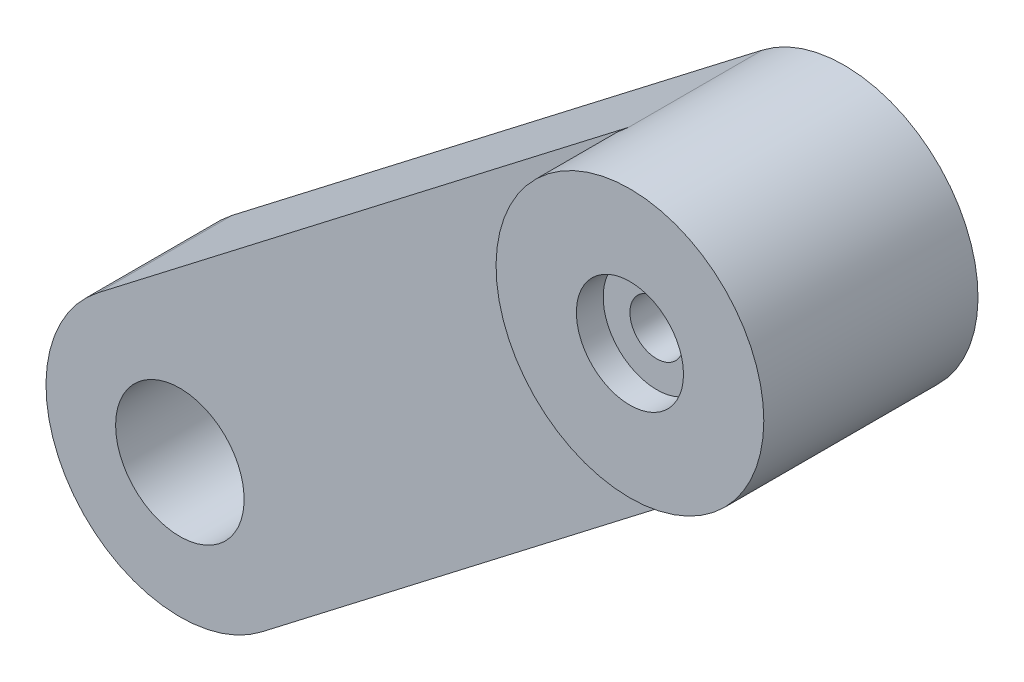
ISO-10303-21;
HEADER;
FILE_DESCRIPTION(('STEP AP214'),'2;1');
FILE_NAME('part.step','',(''),(''),'','','');
FILE_SCHEMA(('AUTOMOTIVE_DESIGN { 1 0 10303 214 1 1 1 1 }'));
ENDSEC;
DATA;
#1=APPLICATION_CONTEXT('core data for automotive mechanical design processes');
#2=APPLICATION_PROTOCOL_DEFINITION('international standard','automotive_design',2000,#1);
#3=PRODUCT_CONTEXT('',#1,'mechanical');
#4=PRODUCT('Part','Part','',(#3));
#5=PRODUCT_RELATED_PRODUCT_CATEGORY('part','',(#4));
#6=PRODUCT_DEFINITION_FORMATION('','',#4);
#7=PRODUCT_DEFINITION_CONTEXT('part definition',#1,'design');
#8=PRODUCT_DEFINITION('design','',#6,#7);
#9=PRODUCT_DEFINITION_SHAPE('','',#8);
#10=(LENGTH_UNIT() NAMED_UNIT(*) SI_UNIT(.MILLI.,.METRE.));
#11=(NAMED_UNIT(*) PLANE_ANGLE_UNIT() SI_UNIT($,.RADIAN.));
#12=(NAMED_UNIT(*) SI_UNIT($,.STERADIAN.) SOLID_ANGLE_UNIT());
#13=UNCERTAINTY_MEASURE_WITH_UNIT(LENGTH_MEASURE(1.E-05),#10,'distance_accuracy_value','');
#14=(GEOMETRIC_REPRESENTATION_CONTEXT(3) GLOBAL_UNCERTAINTY_ASSIGNED_CONTEXT((#13)) GLOBAL_UNIT_ASSIGNED_CONTEXT((#10,
#11,#12)) REPRESENTATION_CONTEXT('',''));
#15=CARTESIAN_POINT('',(0.,0.,0.));
#16=DIRECTION('',(0.,0.,1.));
#17=DIRECTION('',(1.,0.,0.));
#18=AXIS2_PLACEMENT_3D('',#15,#16,#17);
#19=CARTESIAN_POINT('',(-24.5716026079148,99.9472921619681,8.));
#20=DIRECTION('',(0.,0.,-1.));
#21=DIRECTION('',(-1.,0.,0.));
#22=AXIS2_PLACEMENT_3D('',#19,#20,#21);
#23=CYLINDRICAL_SURFACE('',#22,1.00000000000002);
#24=CARTESIAN_POINT('',(-24.5716026079148,99.9472921619681,5.));
#25=DIRECTION('',(0.,0.,1.));
#26=DIRECTION('',(1.,0.,0.));
#27=AXIS2_PLACEMENT_3D('',#24,#25,#26);
#28=CIRCLE('',#27,1.00000000000002);
#29=CARTESIAN_POINT('',(-23.5716026079148,99.9472921619681,5.));
#30=VERTEX_POINT('',#29);
#31=EDGE_CURVE('E123',#30,#30,#28,.T.);
#32=ORIENTED_EDGE('',*,*,#31,.F.);
#33=EDGE_LOOP('',(#32));
#34=FACE_BOUND('',#33,.T.);
#35=CARTESIAN_POINT('',(-24.5716026079148,99.9472921619681,7.));
#36=DIRECTION('',(0.,0.,1.));
#37=DIRECTION('',(1.,0.,0.));
#38=AXIS2_PLACEMENT_3D('',#35,#36,#37);
#39=CIRCLE('',#38,1.00000000000002);
#40=CARTESIAN_POINT('',(-23.5716026079148,99.9472921619681,7.));
#41=VERTEX_POINT('',#40);
#42=EDGE_CURVE('E42',#41,#41,#39,.T.);
#43=ORIENTED_EDGE('',*,*,#42,.T.);
#44=EDGE_LOOP('',(#43));
#45=FACE_BOUND('',#44,.T.);
#46=ADVANCED_FACE('F38',(#34,#45),#23,.F.);
#47=CARTESIAN_POINT('',(-54.4085511361733,70.6633839518424,5.));
#48=DIRECTION('',(-0.610077729525656,0.792341570244058,0.));
#49=DIRECTION('',(-0.792341570244058,-0.610077729525656,0.));
#50=AXIS2_PLACEMENT_3D('',#47,#48,#49);
#51=PLANE('',#50);
#52=DIRECTION('',(0.792341570244058,0.610077729525656,0.));
#53=VECTOR('',#52,1.);
#54=CARTESIAN_POINT('',(-54.4085511361733,70.6633839518424,0.));
#55=LINE('',#54,#53);
#56=CARTESIAN_POINT('',(-41.3297532163879,80.7336410726064,0.));
#57=VERTEX_POINT('',#56);
#58=CARTESIAN_POINT('',(-21.5212139602865,95.9855843107478,0.));
#59=VERTEX_POINT('',#58);
#60=EDGE_CURVE('E167',#57,#59,#55,.T.);
#61=ORIENTED_EDGE('',*,*,#60,.T.);
#62=DIRECTION('',(0.,0.,-1.));
#63=VECTOR('',#62,1.);
#64=CARTESIAN_POINT('',(-21.5212139602865,95.9855843107478,5.));
#65=LINE('',#64,#63);
#66=CARTESIAN_POINT('',(-21.5212139602865,95.9855843107478,5.));
#67=VERTEX_POINT('',#66);
#68=EDGE_CURVE('E13',#67,#59,#65,.T.);
#69=ORIENTED_EDGE('',*,*,#68,.F.);
#70=DIRECTION('',(0.792341570244058,0.610077729525656,0.));
#71=VECTOR('',#70,1.);
#72=CARTESIAN_POINT('',(-54.4085511361733,70.6633839518424,5.));
#73=LINE('',#72,#71);
#74=CARTESIAN_POINT('',(-41.3297532163879,80.7336410726064,5.));
#75=VERTEX_POINT('',#74);
#76=EDGE_CURVE('E87',#75,#67,#73,.T.);
#77=ORIENTED_EDGE('',*,*,#76,.F.);
#78=DIRECTION('',(0.,0.,-1.));
#79=VECTOR('',#78,1.);
#80=CARTESIAN_POINT('',(-41.3297532163879,80.7336410726064,5.));
#81=LINE('',#80,#79);
#82=EDGE_CURVE('E164',#75,#57,#81,.T.);
#83=ORIENTED_EDGE('',*,*,#82,.T.);
#84=EDGE_LOOP('',(#61,#69,#77,#83));
#85=FACE_BOUND('',#84,.T.);
#86=ADVANCED_FACE('F180',(#85),#51,.F.);
#87=CARTESIAN_POINT('',(-24.5716026079148,99.9472921619681,5.));
#88=DIRECTION('',(0.,0.,-1.));
#89=DIRECTION('',(-1.,0.,0.));
#90=AXIS2_PLACEMENT_3D('',#87,#88,#89);
#91=CYLINDRICAL_SURFACE('',#90,4.99999999999998);
#92=CARTESIAN_POINT('',(-24.5716026079148,99.9472921619681,0.));
#93=DIRECTION('',(0.,0.,1.));
#94=DIRECTION('',(1.,0.,0.));
#95=AXIS2_PLACEMENT_3D('',#92,#93,#94);
#96=CIRCLE('',#95,4.99999999999998);
#97=CARTESIAN_POINT('',(-27.621991255543,103.909000013188,0.));
#98=VERTEX_POINT('',#97);
#99=EDGE_CURVE('E117',#59,#98,#96,.T.);
#100=ORIENTED_EDGE('',*,*,#99,.T.);
#101=DIRECTION('',(0.,0.,-1.));
#102=VECTOR('',#101,1.);
#103=CARTESIAN_POINT('',(-27.621991255543,103.909000013188,5.));
#104=LINE('',#103,#102);
#105=CARTESIAN_POINT('',(-27.6219912555431,103.909000013188,5.));
#106=VERTEX_POINT('',#105);
#107=EDGE_CURVE('E47',#106,#98,#104,.T.);
#108=ORIENTED_EDGE('',*,*,#107,.F.);
#109=CARTESIAN_POINT('',(-24.5716026079148,99.9472921619681,5.));
#110=DIRECTION('',(0.,0.,1.));
#111=DIRECTION('',(1.,0.,0.));
#112=AXIS2_PLACEMENT_3D('',#109,#110,#111);
#113=CIRCLE('',#112,4.99999999999998);
#114=EDGE_CURVE('E116',#106,#67,#113,.T.);
#115=ORIENTED_EDGE('',*,*,#114,.T.);
#116=ORIENTED_EDGE('',*,*,#68,.T.);
#117=EDGE_LOOP('',(#100,#108,#115,#116));
#118=FACE_BOUND('',#117,.T.);
#119=CARTESIAN_POINT('',(-24.5716026079148,99.9472921619681,8.));
#120=DIRECTION('',(0.,0.,1.));
#121=DIRECTION('',(1.,0.,0.));
#122=AXIS2_PLACEMENT_3D('',#119,#120,#121);
#123=CIRCLE('',#122,4.99999999999998);
#124=CARTESIAN_POINT('',(-19.5716026079148,99.9472921619681,8.));
#125=VERTEX_POINT('',#124);
#126=EDGE_CURVE('E122',#125,#125,#123,.T.);
#127=ORIENTED_EDGE('',*,*,#126,.F.);
#128=EDGE_LOOP('',(#127));
#129=FACE_BOUND('',#128,.T.);
#130=ADVANCED_FACE('F114',(#118,#129),#91,.T.);
#131=CARTESIAN_POINT('',(-60.5093284314299,78.5867996542829,5.));
#132=DIRECTION('',(-0.610077729525657,0.792341570244058,0.));
#133=DIRECTION('',(-0.792341570244058,-0.610077729525657,0.));
#134=AXIS2_PLACEMENT_3D('',#131,#132,#133);
#135=PLANE('',#134);
#136=DIRECTION('',(0.792341570244058,0.610077729525657,0.));
#137=VECTOR('',#136,1.);
#138=CARTESIAN_POINT('',(-60.5093284314299,78.5867996542829,0.));
#139=LINE('',#138,#137);
#140=CARTESIAN_POINT('',(-47.4305305116445,88.6570567750469,0.));
#141=VERTEX_POINT('',#140);
#142=EDGE_CURVE('E171',#141,#98,#139,.T.);
#143=ORIENTED_EDGE('',*,*,#142,.F.);
#144=DIRECTION('',(0.,0.,-1.));
#145=VECTOR('',#144,1.);
#146=CARTESIAN_POINT('',(-47.4305305116445,88.6570567750469,5.));
#147=LINE('',#146,#145);
#148=CARTESIAN_POINT('',(-47.4305305116445,88.6570567750469,5.));
#149=VERTEX_POINT('',#148);
#150=EDGE_CURVE('E110',#149,#141,#147,.T.);
#151=ORIENTED_EDGE('',*,*,#150,.F.);
#152=DIRECTION('',(0.792341570244058,0.610077729525657,0.));
#153=VECTOR('',#152,1.);
#154=CARTESIAN_POINT('',(-60.5093284314299,78.5867996542829,5.));
#155=LINE('',#154,#153);
#156=EDGE_CURVE('E105',#149,#106,#155,.T.);
#157=ORIENTED_EDGE('',*,*,#156,.T.);
#158=ORIENTED_EDGE('',*,*,#107,.T.);
#159=EDGE_LOOP('',(#143,#151,#157,#158));
#160=FACE_BOUND('',#159,.T.);
#161=ADVANCED_FACE('F108',(#160),#135,.T.);
#162=CARTESIAN_POINT('',(-24.5716026079148,99.9472921619681,5.));
#163=DIRECTION('',(0.,0.,-1.));
#164=DIRECTION('',(-1.,0.,0.));
#165=AXIS2_PLACEMENT_3D('',#162,#163,#164);
#166=CYLINDRICAL_SURFACE('',#165,2.4);
#167=CARTESIAN_POINT('',(-24.5716026079148,99.9472921619681,5.));
#168=DIRECTION('',(0.,0.,1.));
#169=DIRECTION('',(1.,0.,0.));
#170=AXIS2_PLACEMENT_3D('',#167,#168,#169);
#171=CIRCLE('',#170,2.4);
#172=CARTESIAN_POINT('',(-22.1716026079148,99.9472921619681,5.));
#173=VERTEX_POINT('',#172);
#174=EDGE_CURVE('E126',#173,#173,#171,.T.);
#175=ORIENTED_EDGE('',*,*,#174,.T.);
#176=EDGE_LOOP('',(#175));
#177=FACE_BOUND('',#176,.T.);
#178=CARTESIAN_POINT('',(-24.5716026079148,99.9472921619681,0.));
#179=DIRECTION('',(0.,0.,1.));
#180=DIRECTION('',(1.,0.,0.));
#181=AXIS2_PLACEMENT_3D('',#178,#179,#180);
#182=CIRCLE('',#181,2.4);
#183=CARTESIAN_POINT('',(-22.1716026079148,99.9472921619681,0.));
#184=VERTEX_POINT('',#183);
#185=EDGE_CURVE('E157',#184,#184,#182,.T.);
#186=ORIENTED_EDGE('',*,*,#185,.F.);
#187=EDGE_LOOP('',(#186));
#188=FACE_BOUND('',#187,.T.);
#189=ADVANCED_FACE('F40',(#177,#188),#166,.F.);
#190=CARTESIAN_POINT('',(-44.3801418640163,84.6953489238267,5.));
#191=DIRECTION('',(0.,0.,-1.));
#192=DIRECTION('',(-1.,0.,0.));
#193=AXIS2_PLACEMENT_3D('',#190,#191,#192);
#194=CYLINDRICAL_SURFACE('',#193,4.99999999999997);
#195=CARTESIAN_POINT('',(-44.3801418640163,84.6953489238267,0.));
#196=DIRECTION('',(0.,0.,1.));
#197=DIRECTION('',(1.,0.,0.));
#198=AXIS2_PLACEMENT_3D('',#195,#196,#197);
#199=CIRCLE('',#198,4.99999999999997);
#200=EDGE_CURVE('E83',#141,#57,#199,.T.);
#201=ORIENTED_EDGE('',*,*,#200,.T.);
#202=ORIENTED_EDGE('',*,*,#82,.F.);
#203=CARTESIAN_POINT('',(-44.3801418640163,84.6953489238267,5.));
#204=DIRECTION('',(0.,0.,1.));
#205=DIRECTION('',(1.,0.,0.));
#206=AXIS2_PLACEMENT_3D('',#203,#204,#205);
#207=CIRCLE('',#206,4.99999999999997);
#208=EDGE_CURVE('E63',#149,#75,#207,.T.);
#209=ORIENTED_EDGE('',*,*,#208,.F.);
#210=ORIENTED_EDGE('',*,*,#150,.T.);
#211=EDGE_LOOP('',(#201,#202,#209,#210));
#212=FACE_BOUND('',#211,.T.);
#213=ADVANCED_FACE('F175',(#212),#194,.T.);
#214=CARTESIAN_POINT('',(0.,0.,5.));
#215=DIRECTION('',(0.,0.,1.));
#216=DIRECTION('',(1.,0.,0.));
#217=AXIS2_PLACEMENT_3D('',#214,#215,#216);
#218=PLANE('',#217);
#219=ORIENTED_EDGE('',*,*,#114,.F.);
#220=ORIENTED_EDGE('',*,*,#156,.F.);
#221=ORIENTED_EDGE('',*,*,#208,.T.);
#222=ORIENTED_EDGE('',*,*,#76,.T.);
#223=EDGE_LOOP('',(#219,#220,#221,#222));
#224=FACE_BOUND('',#223,.T.);
#225=CARTESIAN_POINT('',(-44.3801418640163,84.6953489238267,5.));
#226=DIRECTION('',(0.,0.,-1.));
#227=DIRECTION('',(-1.,0.,0.));
#228=AXIS2_PLACEMENT_3D('',#225,#226,#227);
#229=CIRCLE('',#228,2.4);
#230=CARTESIAN_POINT('',(-46.7801418640163,84.6953489238267,5.));
#231=VERTEX_POINT('',#230);
#232=EDGE_CURVE('E154',#231,#231,#229,.T.);
#233=ORIENTED_EDGE('',*,*,#232,.T.);
#234=EDGE_LOOP('',(#233));
#235=FACE_BOUND('',#234,.T.);
#236=ADVANCED_FACE('F120',(#224,#235),#218,.T.);
#237=CARTESIAN_POINT('',(0.,0.,0.));
#238=DIRECTION('',(0.,0.,1.));
#239=DIRECTION('',(1.,0.,0.));
#240=AXIS2_PLACEMENT_3D('',#237,#238,#239);
#241=PLANE('',#240);
#242=DIRECTION('',(0.381149063542978,0.924513597174379,0.));
#243=VECTOR('',#242,1.);
#244=CARTESIAN_POINT('',(-41.21077558304,87.1356598419294,0.));
#245=LINE('',#244,#243);
#246=CARTESIAN_POINT('',(-41.21077558304,87.1356598419294,0.));
#247=VERTEX_POINT('',#246);
#248=CARTESIAN_POINT('',(-40.0673283924111,89.9092006334525,0.));
#249=VERTEX_POINT('',#248);
#250=EDGE_CURVE('E143',#247,#249,#245,.T.);
#251=ORIENTED_EDGE('',*,*,#250,.F.);
#252=DIRECTION('',(-0.991226793068634,-0.132172026930328,0.));
#253=VECTOR('',#252,1.);
#254=CARTESIAN_POINT('',(-38.2370952038341,87.5321759227203,0.));
#255=LINE('',#254,#253);
#256=CARTESIAN_POINT('',(-38.2370952038341,87.5321759227203,0.));
#257=VERTEX_POINT('',#256);
#258=EDGE_CURVE('E54',#257,#247,#255,.T.);
#259=ORIENTED_EDGE('',*,*,#258,.F.);
#260=DIRECTION('',(0.610077729525658,-0.792341570244057,0.));
#261=VECTOR('',#260,1.);
#262=CARTESIAN_POINT('',(-38.2370952038341,87.5321759227203,0.));
#263=LINE('',#262,#261);
#264=EDGE_CURVE('E135',#249,#257,#263,.T.);
#265=ORIENTED_EDGE('',*,*,#264,.F.);
#266=EDGE_LOOP('',(#251,#259,#265));
#267=FACE_BOUND('',#266,.T.);
#268=CARTESIAN_POINT('',(-44.3801418640163,84.6953489238267,0.));
#269=DIRECTION('',(0.,0.,-1.));
#270=DIRECTION('',(-1.,0.,0.));
#271=AXIS2_PLACEMENT_3D('',#268,#269,#270);
#272=CIRCLE('',#271,2.4);
#273=CARTESIAN_POINT('',(-46.7801418640163,84.6953489238267,0.));
#274=VERTEX_POINT('',#273);
#275=EDGE_CURVE('E150',#274,#274,#272,.T.);
#276=ORIENTED_EDGE('',*,*,#275,.F.);
#277=EDGE_LOOP('',(#276));
#278=FACE_BOUND('',#277,.T.);
#279=ORIENTED_EDGE('',*,*,#185,.T.);
#280=EDGE_LOOP('',(#279));
#281=FACE_BOUND('',#280,.T.);
#282=ORIENTED_EDGE('',*,*,#60,.F.);
#283=ORIENTED_EDGE('',*,*,#200,.F.);
#284=ORIENTED_EDGE('',*,*,#142,.T.);
#285=ORIENTED_EDGE('',*,*,#99,.F.);
#286=EDGE_LOOP('',(#282,#283,#284,#285));
#287=FACE_BOUND('',#286,.T.);
#288=ADVANCED_FACE('F178',(#267,#278,#281,#287),#241,.F.);
#289=CARTESIAN_POINT('',(-44.3801418640163,84.6953489238267,5.));
#290=DIRECTION('',(0.,0.,-1.));
#291=DIRECTION('',(-1.,0.,0.));
#292=AXIS2_PLACEMENT_3D('',#289,#290,#291);
#293=CYLINDRICAL_SURFACE('',#292,2.4);
#294=ORIENTED_EDGE('',*,*,#232,.F.);
#295=EDGE_LOOP('',(#294));
#296=FACE_BOUND('',#295,.T.);
#297=ORIENTED_EDGE('',*,*,#275,.T.);
#298=EDGE_LOOP('',(#297));
#299=FACE_BOUND('',#298,.T.);
#300=ADVANCED_FACE('F198',(#296,#299),#293,.F.);
#301=CARTESIAN_POINT('',(-38.2370952038341,87.5321759227203,1.));
#302=DIRECTION('',(0.132172026930328,-0.991226793068634,0.));
#303=DIRECTION('',(0.991226793068634,0.132172026930328,0.));
#304=AXIS2_PLACEMENT_3D('',#301,#302,#303);
#305=PLANE('',#304);
#306=ORIENTED_EDGE('',*,*,#258,.T.);
#307=DIRECTION('',(0.,0.,-1.));
#308=VECTOR('',#307,1.);
#309=CARTESIAN_POINT('',(-41.21077558304,87.1356598419294,1.));
#310=LINE('',#309,#308);
#311=CARTESIAN_POINT('',(-41.21077558304,87.1356598419294,1.));
#312=VERTEX_POINT('',#311);
#313=EDGE_CURVE('E141',#312,#247,#310,.T.);
#314=ORIENTED_EDGE('',*,*,#313,.F.);
#315=DIRECTION('',(-0.991226793068634,-0.132172026930328,0.));
#316=VECTOR('',#315,1.);
#317=CARTESIAN_POINT('',(-38.2370952038341,87.5321759227203,1.));
#318=LINE('',#317,#316);
#319=CARTESIAN_POINT('',(-38.2370952038341,87.5321759227203,1.));
#320=VERTEX_POINT('',#319);
#321=EDGE_CURVE('E131',#320,#312,#318,.T.);
#322=ORIENTED_EDGE('',*,*,#321,.F.);
#323=DIRECTION('',(0.,0.,-1.));
#324=VECTOR('',#323,1.);
#325=CARTESIAN_POINT('',(-38.2370952038341,87.5321759227203,1.));
#326=LINE('',#325,#324);
#327=EDGE_CURVE('E148',#320,#257,#326,.T.);
#328=ORIENTED_EDGE('',*,*,#327,.T.);
#329=EDGE_LOOP('',(#306,#314,#322,#328));
#330=FACE_BOUND('',#329,.T.);
#331=ADVANCED_FACE('F204',(#330),#305,.F.);
#332=CARTESIAN_POINT('',(-38.2370952038341,87.5321759227203,1.));
#333=DIRECTION('',(0.792341570244057,0.610077729525658,0.));
#334=DIRECTION('',(-0.610077729525658,0.792341570244057,0.));
#335=AXIS2_PLACEMENT_3D('',#332,#333,#334);
#336=PLANE('',#335);
#337=ORIENTED_EDGE('',*,*,#264,.T.);
#338=ORIENTED_EDGE('',*,*,#327,.F.);
#339=DIRECTION('',(0.610077729525658,-0.792341570244057,0.));
#340=VECTOR('',#339,1.);
#341=CARTESIAN_POINT('',(-38.2370952038341,87.5321759227203,1.));
#342=LINE('',#341,#340);
#343=CARTESIAN_POINT('',(-40.0673283924111,89.9092006334525,1.));
#344=VERTEX_POINT('',#343);
#345=EDGE_CURVE('E138',#344,#320,#342,.T.);
#346=ORIENTED_EDGE('',*,*,#345,.F.);
#347=DIRECTION('',(0.,0.,-1.));
#348=VECTOR('',#347,1.);
#349=CARTESIAN_POINT('',(-40.0673283924111,89.9092006334525,1.));
#350=LINE('',#349,#348);
#351=EDGE_CURVE('E151',#344,#249,#350,.T.);
#352=ORIENTED_EDGE('',*,*,#351,.T.);
#353=EDGE_LOOP('',(#337,#338,#346,#352));
#354=FACE_BOUND('',#353,.T.);
#355=ADVANCED_FACE('F208',(#354),#336,.F.);
#356=CARTESIAN_POINT('',(-41.21077558304,87.1356598419294,1.));
#357=DIRECTION('',(-0.924513597174379,0.381149063542978,0.));
#358=DIRECTION('',(-0.381149063542978,-0.92451359717438,0.));
#359=AXIS2_PLACEMENT_3D('',#356,#357,#358);
#360=PLANE('',#359);
#361=ORIENTED_EDGE('',*,*,#250,.T.);
#362=ORIENTED_EDGE('',*,*,#351,.F.);
#363=DIRECTION('',(0.381149063542978,0.924513597174379,0.));
#364=VECTOR('',#363,1.);
#365=CARTESIAN_POINT('',(-41.21077558304,87.1356598419294,1.));
#366=LINE('',#365,#364);
#367=EDGE_CURVE('E134',#312,#344,#366,.T.);
#368=ORIENTED_EDGE('',*,*,#367,.F.);
#369=ORIENTED_EDGE('',*,*,#313,.T.);
#370=EDGE_LOOP('',(#361,#362,#368,#369));
#371=FACE_BOUND('',#370,.T.);
#372=ADVANCED_FACE('F209',(#371),#360,.F.);
#373=CARTESIAN_POINT('',(0.,0.,1.));
#374=DIRECTION('',(0.,0.,-1.));
#375=DIRECTION('',(-1.,0.,0.));
#376=AXIS2_PLACEMENT_3D('',#373,#374,#375);
#377=PLANE('',#376);
#378=ORIENTED_EDGE('',*,*,#321,.T.);
#379=ORIENTED_EDGE('',*,*,#367,.T.);
#380=ORIENTED_EDGE('',*,*,#345,.T.);
#381=EDGE_LOOP('',(#378,#379,#380));
#382=FACE_BOUND('',#381,.T.);
#383=ADVANCED_FACE('F212',(#382),#377,.T.);
#384=CARTESIAN_POINT('',(-24.5716026079148,99.9472921619681,8.));
#385=DIRECTION('',(0.,0.,1.));
#386=DIRECTION('',(1.,0.,0.));
#387=AXIS2_PLACEMENT_3D('',#384,#385,#386);
#388=PLANE('',#387);
#389=CARTESIAN_POINT('',(-24.5716026079148,99.9472921619681,8.));
#390=DIRECTION('',(0.,0.,1.));
#391=DIRECTION('',(1.,0.,0.));
#392=AXIS2_PLACEMENT_3D('',#389,#390,#391);
#393=CIRCLE('',#392,2.);
#394=CARTESIAN_POINT('',(-22.5716026079148,99.9472921619681,8.));
#395=VERTEX_POINT('',#394);
#396=EDGE_CURVE('E243',#395,#395,#393,.T.);
#397=ORIENTED_EDGE('',*,*,#396,.F.);
#398=EDGE_LOOP('',(#397));
#399=FACE_BOUND('',#398,.T.);
#400=ORIENTED_EDGE('',*,*,#126,.T.);
#401=EDGE_LOOP('',(#400));
#402=FACE_BOUND('',#401,.T.);
#403=ADVANCED_FACE('F219',(#399,#402),#388,.T.);
#404=CARTESIAN_POINT('',(-24.5716026079148,99.9472921619681,5.));
#405=DIRECTION('',(0.,0.,1.));
#406=DIRECTION('',(1.,0.,0.));
#407=AXIS2_PLACEMENT_3D('',#404,#405,#406);
#408=PLANE('',#407);
#409=ORIENTED_EDGE('',*,*,#174,.F.);
#410=EDGE_LOOP('',(#409));
#411=FACE_BOUND('',#410,.T.);
#412=ORIENTED_EDGE('',*,*,#31,.T.);
#413=EDGE_LOOP('',(#412));
#414=FACE_BOUND('',#413,.T.);
#415=ADVANCED_FACE('F221',(#411,#414),#408,.F.);
#416=CARTESIAN_POINT('',(-24.5716026079148,99.9472921619681,-0.656854249492385));
#417=DIRECTION('',(0.,0.,1.));
#418=DIRECTION('',(1.,0.,0.));
#419=AXIS2_PLACEMENT_3D('',#416,#417,#418);
#420=CYLINDRICAL_SURFACE('',#419,2.);
#421=CARTESIAN_POINT('',(-24.5716026079148,99.9472921619681,7.));
#422=DIRECTION('',(0.,0.,1.));
#423=DIRECTION('',(1.,0.,0.));
#424=AXIS2_PLACEMENT_3D('',#421,#422,#423);
#425=CIRCLE('',#424,2.);
#426=CARTESIAN_POINT('',(-22.5716026079148,99.9472921619681,7.));
#427=VERTEX_POINT('',#426);
#428=EDGE_CURVE('E242',#427,#427,#425,.F.);
#429=ORIENTED_EDGE('',*,*,#428,.T.);
#430=EDGE_LOOP('',(#429));
#431=FACE_BOUND('',#430,.T.);
#432=ORIENTED_EDGE('',*,*,#396,.T.);
#433=EDGE_LOOP('',(#432));
#434=FACE_BOUND('',#433,.T.);
#435=ADVANCED_FACE('F224',(#431,#434),#420,.F.);
#436=CARTESIAN_POINT('',(0.,0.,7.));
#437=DIRECTION('',(0.,0.,1.));
#438=DIRECTION('',(1.,0.,0.));
#439=AXIS2_PLACEMENT_3D('',#436,#437,#438);
#440=PLANE('',#439);
#441=ORIENTED_EDGE('',*,*,#42,.F.);
#442=EDGE_LOOP('',(#441));
#443=FACE_BOUND('',#442,.T.);
#444=ORIENTED_EDGE('',*,*,#428,.F.);
#445=EDGE_LOOP('',(#444));
#446=FACE_BOUND('',#445,.T.);
#447=ADVANCED_FACE('F231',(#443,#446),#440,.T.);
#448=CLOSED_SHELL('',(#46,#86,#130,#161,#189,#213,#236,#288,#300,#331,#355,#372,#383,#403,#415,
#435,#447));
#449=MANIFOLD_SOLID_BREP('B2',#448);
#450=ADVANCED_BREP_SHAPE_REPRESENTATION('',(#18,#449),#14);
#451=SHAPE_DEFINITION_REPRESENTATION(#9,#450);
ENDSEC;
END-ISO-10303-21;
